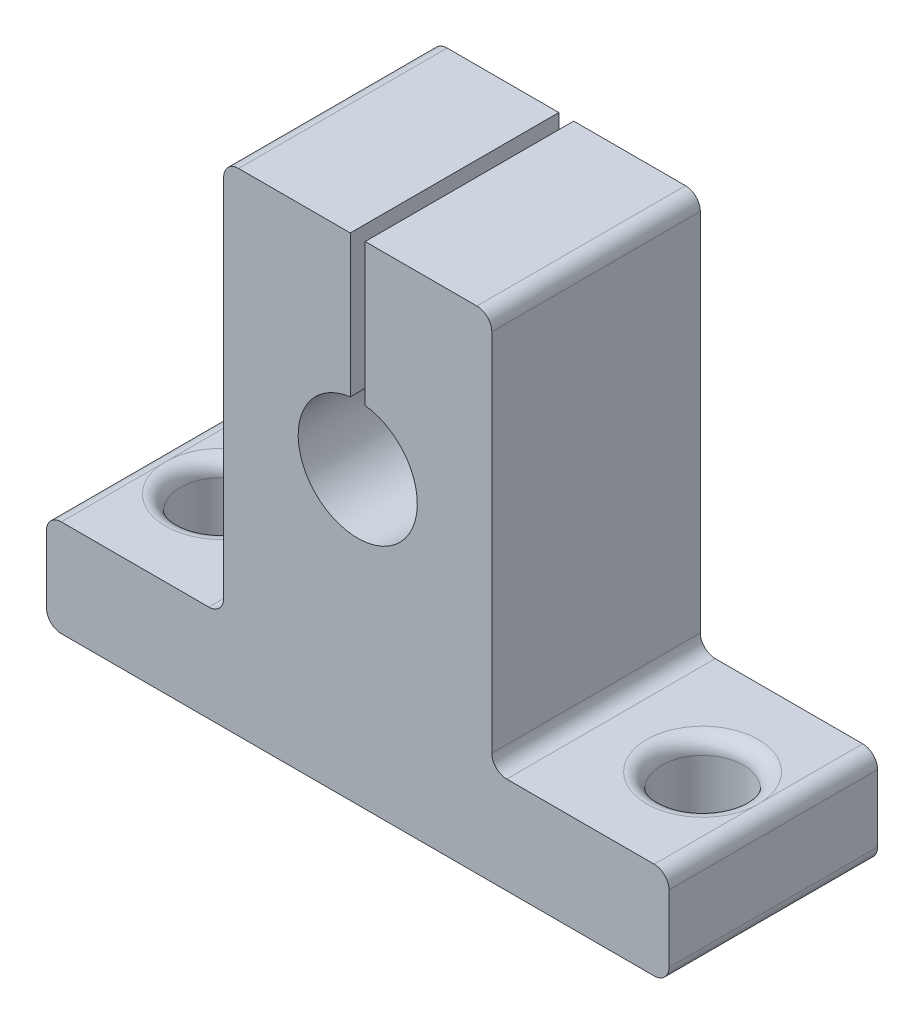
ISO-10303-21;
HEADER;
FILE_DESCRIPTION(('STEP AP214'),'2;1');
FILE_NAME('part.step','',(''),(''),'','','');
FILE_SCHEMA(('AUTOMOTIVE_DESIGN { 1 0 10303 214 1 1 1 1 }'));
ENDSEC;
DATA;
#1=APPLICATION_CONTEXT('core data for automotive mechanical design processes');
#2=APPLICATION_PROTOCOL_DEFINITION('international standard','automotive_design',2000,#1);
#3=PRODUCT_CONTEXT('',#1,'mechanical');
#4=PRODUCT('Part','Part','',(#3));
#5=PRODUCT_RELATED_PRODUCT_CATEGORY('part','',(#4));
#6=PRODUCT_DEFINITION_FORMATION('','',#4);
#7=PRODUCT_DEFINITION_CONTEXT('part definition',#1,'design');
#8=PRODUCT_DEFINITION('design','',#6,#7);
#9=PRODUCT_DEFINITION_SHAPE('','',#8);
#10=(LENGTH_UNIT() NAMED_UNIT(*) SI_UNIT(.MILLI.,.METRE.));
#11=(NAMED_UNIT(*) PLANE_ANGLE_UNIT() SI_UNIT($,.RADIAN.));
#12=(NAMED_UNIT(*) SI_UNIT($,.STERADIAN.) SOLID_ANGLE_UNIT());
#13=UNCERTAINTY_MEASURE_WITH_UNIT(LENGTH_MEASURE(1.E-05),#10,'distance_accuracy_value','');
#14=(GEOMETRIC_REPRESENTATION_CONTEXT(3) GLOBAL_UNCERTAINTY_ASSIGNED_CONTEXT((#13)) GLOBAL_UNIT_ASSIGNED_CONTEXT((#10,
#11,#12)) REPRESENTATION_CONTEXT('',''));
#15=CARTESIAN_POINT('',(0.,0.,0.));
#16=DIRECTION('',(0.,0.,1.));
#17=DIRECTION('',(1.,0.,0.));
#18=AXIS2_PLACEMENT_3D('',#15,#16,#17);
#19=CARTESIAN_POINT('',(-0.499999999999996,33.,14.));
#20=DIRECTION('',(-1.,0.,0.));
#21=DIRECTION('',(0.,-1.,0.));
#22=AXIS2_PLACEMENT_3D('',#19,#20,#21);
#23=PLANE('',#22);
#24=DIRECTION('',(0.,1.,0.));
#25=VECTOR('',#24,1.);
#26=CARTESIAN_POINT('',(-0.499999999999996,33.,0.));
#27=LINE('',#26,#25);
#28=CARTESIAN_POINT('',(-0.500000000000003,23.4686269665969,0.));
#29=VERTEX_POINT('',#28);
#30=CARTESIAN_POINT('',(-0.499999999999996,33.,0.));
#31=VERTEX_POINT('',#30);
#32=EDGE_CURVE('E210',#29,#31,#27,.T.);
#33=ORIENTED_EDGE('',*,*,#32,.T.);
#34=DIRECTION('',(0.,0.,-1.));
#35=VECTOR('',#34,1.);
#36=CARTESIAN_POINT('',(-0.499999999999996,33.,14.));
#37=LINE('',#36,#35);
#38=CARTESIAN_POINT('',(-0.499999999999996,33.,14.));
#39=VERTEX_POINT('',#38);
#40=EDGE_CURVE('E189',#39,#31,#37,.T.);
#41=ORIENTED_EDGE('',*,*,#40,.F.);
#42=DIRECTION('',(0.,1.,0.));
#43=VECTOR('',#42,1.);
#44=CARTESIAN_POINT('',(-0.499999999999996,33.,14.));
#45=LINE('',#44,#43);
#46=CARTESIAN_POINT('',(-0.500000000000003,23.4686269665969,14.));
#47=VERTEX_POINT('',#46);
#48=EDGE_CURVE('E197',#47,#39,#45,.T.);
#49=ORIENTED_EDGE('',*,*,#48,.F.);
#50=DIRECTION('',(0.,0.,-1.));
#51=VECTOR('',#50,1.);
#52=CARTESIAN_POINT('',(-0.500000000000003,23.4686269665969,14.));
#53=LINE('',#52,#51);
#54=EDGE_CURVE('E404',#47,#29,#53,.T.);
#55=ORIENTED_EDGE('',*,*,#54,.T.);
#56=EDGE_LOOP('',(#33,#41,#49,#55));
#57=FACE_BOUND('',#56,.T.);
#58=ADVANCED_FACE('F39',(#57),#23,.F.);
#59=CARTESIAN_POINT('',(-0.499999999999996,33.,14.));
#60=DIRECTION('',(0.,-1.,0.));
#61=DIRECTION('',(0.,0.,-1.));
#62=AXIS2_PLACEMENT_3D('',#59,#60,#61);
#63=PLANE('',#62);
#64=DIRECTION('',(-1.,0.,0.));
#65=VECTOR('',#64,1.);
#66=CARTESIAN_POINT('',(-0.499999999999996,33.,0.));
#67=LINE('',#66,#65);
#68=CARTESIAN_POINT('',(-7.99999999999999,33.,0.));
#69=VERTEX_POINT('',#68);
#70=EDGE_CURVE('E355',#31,#69,#67,.T.);
#71=ORIENTED_EDGE('',*,*,#70,.T.);
#72=DIRECTION('',(0.,0.,-1.));
#73=VECTOR('',#72,1.);
#74=CARTESIAN_POINT('',(-7.99999999999999,33.,14.));
#75=LINE('',#74,#73);
#76=CARTESIAN_POINT('',(-7.99999999999999,33.,14.));
#77=VERTEX_POINT('',#76);
#78=EDGE_CURVE('E192',#77,#69,#75,.T.);
#79=ORIENTED_EDGE('',*,*,#78,.F.);
#80=DIRECTION('',(-1.,0.,0.));
#81=VECTOR('',#80,1.);
#82=CARTESIAN_POINT('',(-0.499999999999996,33.,14.));
#83=LINE('',#82,#81);
#84=EDGE_CURVE('E185',#39,#77,#83,.T.);
#85=ORIENTED_EDGE('',*,*,#84,.F.);
#86=ORIENTED_EDGE('',*,*,#40,.T.);
#87=EDGE_LOOP('',(#71,#79,#85,#86));
#88=FACE_BOUND('',#87,.T.);
#89=ADVANCED_FACE('F187',(#88),#63,.F.);
#90=CARTESIAN_POINT('',(-8.,32.,14.));
#91=DIRECTION('',(0.,0.,-1.));
#92=DIRECTION('',(-1.,0.,0.));
#93=AXIS2_PLACEMENT_3D('',#90,#91,#92);
#94=CYLINDRICAL_SURFACE('',#93,1.);
#95=CARTESIAN_POINT('',(-8.,32.,0.));
#96=DIRECTION('',(0.,0.,1.));
#97=DIRECTION('',(1.,0.,0.));
#98=AXIS2_PLACEMENT_3D('',#95,#96,#97);
#99=CIRCLE('',#98,1.);
#100=CARTESIAN_POINT('',(-9.,32.,0.));
#101=VERTEX_POINT('',#100);
#102=EDGE_CURVE('E346',#69,#101,#99,.T.);
#103=ORIENTED_EDGE('',*,*,#102,.T.);
#104=DIRECTION('',(0.,0.,-1.));
#105=VECTOR('',#104,1.);
#106=CARTESIAN_POINT('',(-9.,32.,14.));
#107=LINE('',#106,#105);
#108=CARTESIAN_POINT('',(-9.,32.,14.));
#109=VERTEX_POINT('',#108);
#110=EDGE_CURVE('E219',#109,#101,#107,.T.);
#111=ORIENTED_EDGE('',*,*,#110,.F.);
#112=CARTESIAN_POINT('',(-8.,32.,14.));
#113=DIRECTION('',(0.,0.,1.));
#114=DIRECTION('',(1.,0.,0.));
#115=AXIS2_PLACEMENT_3D('',#112,#113,#114);
#116=CIRCLE('',#115,1.);
#117=EDGE_CURVE('E196',#77,#109,#116,.T.);
#118=ORIENTED_EDGE('',*,*,#117,.F.);
#119=ORIENTED_EDGE('',*,*,#78,.T.);
#120=EDGE_LOOP('',(#103,#111,#118,#119));
#121=FACE_BOUND('',#120,.T.);
#122=ADVANCED_FACE('F262',(#121),#94,.T.);
#123=CARTESIAN_POINT('',(-9.,32.,14.));
#124=DIRECTION('',(1.,0.,0.));
#125=DIRECTION('',(0.,1.,0.));
#126=AXIS2_PLACEMENT_3D('',#123,#124,#125);
#127=PLANE('',#126);
#128=DIRECTION('',(0.,-1.,0.));
#129=VECTOR('',#128,1.);
#130=CARTESIAN_POINT('',(-9.,32.,0.));
#131=LINE('',#130,#129);
#132=CARTESIAN_POINT('',(-9.,7.50000000000001,0.));
#133=VERTEX_POINT('',#132);
#134=EDGE_CURVE('E340',#101,#133,#131,.T.);
#135=ORIENTED_EDGE('',*,*,#134,.T.);
#136=DIRECTION('',(0.,0.,-1.));
#137=VECTOR('',#136,1.);
#138=CARTESIAN_POINT('',(-9.,7.50000000000001,14.));
#139=LINE('',#138,#137);
#140=CARTESIAN_POINT('',(-9.,7.50000000000001,14.));
#141=VERTEX_POINT('',#140);
#142=EDGE_CURVE('E329',#141,#133,#139,.T.);
#143=ORIENTED_EDGE('',*,*,#142,.F.);
#144=DIRECTION('',(0.,-1.,0.));
#145=VECTOR('',#144,1.);
#146=CARTESIAN_POINT('',(-9.,32.,14.));
#147=LINE('',#146,#145);
#148=EDGE_CURVE('E341',#109,#141,#147,.T.);
#149=ORIENTED_EDGE('',*,*,#148,.F.);
#150=ORIENTED_EDGE('',*,*,#110,.T.);
#151=EDGE_LOOP('',(#135,#143,#149,#150));
#152=FACE_BOUND('',#151,.T.);
#153=ADVANCED_FACE('F338',(#152),#127,.F.);
#154=CARTESIAN_POINT('',(-10.,7.5,14.));
#155=DIRECTION('',(0.,0.,-1.));
#156=DIRECTION('',(-1.,0.,0.));
#157=AXIS2_PLACEMENT_3D('',#154,#155,#156);
#158=CYLINDRICAL_SURFACE('',#157,1.);
#159=CARTESIAN_POINT('',(-10.,7.5,0.));
#160=DIRECTION('',(0.,0.,-1.));
#161=DIRECTION('',(-1.,0.,0.));
#162=AXIS2_PLACEMENT_3D('',#159,#160,#161);
#163=CIRCLE('',#162,1.);
#164=CARTESIAN_POINT('',(-10.,6.5,0.));
#165=VERTEX_POINT('',#164);
#166=EDGE_CURVE('E348',#133,#165,#163,.T.);
#167=ORIENTED_EDGE('',*,*,#166,.T.);
#168=DIRECTION('',(0.,0.,-1.));
#169=VECTOR('',#168,1.);
#170=CARTESIAN_POINT('',(-10.,6.5,14.));
#171=LINE('',#170,#169);
#172=CARTESIAN_POINT('',(-10.,6.5,14.));
#173=VERTEX_POINT('',#172);
#174=EDGE_CURVE('E325',#173,#165,#171,.T.);
#175=ORIENTED_EDGE('',*,*,#174,.F.);
#176=CARTESIAN_POINT('',(-10.,7.5,14.));
#177=DIRECTION('',(0.,0.,-1.));
#178=DIRECTION('',(-1.,0.,0.));
#179=AXIS2_PLACEMENT_3D('',#176,#177,#178);
#180=CIRCLE('',#179,1.);
#181=EDGE_CURVE('E490',#141,#173,#180,.T.);
#182=ORIENTED_EDGE('',*,*,#181,.F.);
#183=ORIENTED_EDGE('',*,*,#142,.T.);
#184=EDGE_LOOP('',(#167,#175,#182,#183));
#185=FACE_BOUND('',#184,.T.);
#186=ADVANCED_FACE('F537',(#185),#158,.F.);
#187=CARTESIAN_POINT('',(-10.,6.5,14.));
#188=DIRECTION('',(0.,-1.,0.));
#189=DIRECTION('',(1.,0.,0.));
#190=AXIS2_PLACEMENT_3D('',#187,#188,#189);
#191=PLANE('',#190);
#192=DIRECTION('',(0.,0.,-1.));
#193=VECTOR('',#192,1.);
#194=CARTESIAN_POINT('',(-19.9,6.49999999999999,14.));
#195=LINE('',#194,#193);
#196=CARTESIAN_POINT('',(-19.9,6.49999999999999,7.));
#197=VERTEX_POINT('',#196);
#198=CARTESIAN_POINT('',(-19.9,6.49999999999999,0.));
#199=VERTEX_POINT('',#198);
#200=EDGE_CURVE('E320',#197,#199,#195,.T.);
#201=ORIENTED_EDGE('',*,*,#200,.F.);
#202=CARTESIAN_POINT('',(-16.15,6.5,7.));
#203=DIRECTION('',(0.,-1.,0.));
#204=DIRECTION('',(1.,0.,0.));
#205=AXIS2_PLACEMENT_3D('',#202,#203,#204);
#206=CIRCLE('',#205,3.75);
#207=EDGE_CURVE('E11',#197,#197,#206,.T.);
#208=ORIENTED_EDGE('',*,*,#207,.T.);
#209=CARTESIAN_POINT('',(-19.9,6.49999999999999,14.));
#210=VERTEX_POINT('',#209);
#211=EDGE_CURVE('E321',#210,#197,#195,.T.);
#212=ORIENTED_EDGE('',*,*,#211,.F.);
#213=DIRECTION('',(-1.,0.,0.));
#214=VECTOR('',#213,1.);
#215=CARTESIAN_POINT('',(-10.,6.5,14.));
#216=LINE('',#215,#214);
#217=EDGE_CURVE('E495',#173,#210,#216,.T.);
#218=ORIENTED_EDGE('',*,*,#217,.F.);
#219=ORIENTED_EDGE('',*,*,#174,.T.);
#220=DIRECTION('',(-1.,0.,0.));
#221=VECTOR('',#220,1.);
#222=CARTESIAN_POINT('',(-10.,6.5,0.));
#223=LINE('',#222,#221);
#224=EDGE_CURVE('E353',#165,#199,#223,.T.);
#225=ORIENTED_EDGE('',*,*,#224,.T.);
#226=EDGE_LOOP('',(#201,#208,#212,#218,#219,#225));
#227=FACE_BOUND('',#226,.T.);
#228=ADVANCED_FACE('F532',(#227),#191,.F.);
#229=CARTESIAN_POINT('',(-19.9,5.49999999999999,14.));
#230=DIRECTION('',(0.,0.,-1.));
#231=DIRECTION('',(-1.,0.,0.));
#232=AXIS2_PLACEMENT_3D('',#229,#230,#231);
#233=CYLINDRICAL_SURFACE('',#232,1.);
#234=CARTESIAN_POINT('',(-19.9,5.49999999999999,0.));
#235=DIRECTION('',(0.,0.,1.));
#236=DIRECTION('',(1.,0.,0.));
#237=AXIS2_PLACEMENT_3D('',#234,#235,#236);
#238=CIRCLE('',#237,1.);
#239=CARTESIAN_POINT('',(-20.9,5.49999999999999,0.));
#240=VERTEX_POINT('',#239);
#241=EDGE_CURVE('E362',#199,#240,#238,.T.);
#242=ORIENTED_EDGE('',*,*,#241,.T.);
#243=DIRECTION('',(0.,0.,-1.));
#244=VECTOR('',#243,1.);
#245=CARTESIAN_POINT('',(-20.9,5.49999999999999,14.));
#246=LINE('',#245,#244);
#247=CARTESIAN_POINT('',(-20.9,5.49999999999999,14.));
#248=VERTEX_POINT('',#247);
#249=EDGE_CURVE('E316',#248,#240,#246,.T.);
#250=ORIENTED_EDGE('',*,*,#249,.F.);
#251=CARTESIAN_POINT('',(-19.9,5.49999999999999,14.));
#252=DIRECTION('',(0.,0.,1.));
#253=DIRECTION('',(1.,0.,0.));
#254=AXIS2_PLACEMENT_3D('',#251,#252,#253);
#255=CIRCLE('',#254,1.);
#256=EDGE_CURVE('E498',#210,#248,#255,.T.);
#257=ORIENTED_EDGE('',*,*,#256,.F.);
#258=ORIENTED_EDGE('',*,*,#211,.T.);
#259=ORIENTED_EDGE('',*,*,#200,.T.);
#260=EDGE_LOOP('',(#242,#250,#257,#258,#259));
#261=FACE_BOUND('',#260,.T.);
#262=ADVANCED_FACE('F527',(#261),#233,.T.);
#263=CARTESIAN_POINT('',(-20.9,5.49999999999999,14.));
#264=DIRECTION('',(1.,0.,0.));
#265=DIRECTION('',(0.,0.,-1.));
#266=AXIS2_PLACEMENT_3D('',#263,#264,#265);
#267=PLANE('',#266);
#268=DIRECTION('',(0.,-1.,0.));
#269=VECTOR('',#268,1.);
#270=CARTESIAN_POINT('',(-20.9,5.49999999999999,0.));
#271=LINE('',#270,#269);
#272=CARTESIAN_POINT('',(-20.9,1.00000000000001,0.));
#273=VERTEX_POINT('',#272);
#274=EDGE_CURVE('E365',#240,#273,#271,.T.);
#275=ORIENTED_EDGE('',*,*,#274,.T.);
#276=DIRECTION('',(0.,0.,-1.));
#277=VECTOR('',#276,1.);
#278=CARTESIAN_POINT('',(-20.9,1.00000000000001,14.));
#279=LINE('',#278,#277);
#280=CARTESIAN_POINT('',(-20.9,1.00000000000001,14.));
#281=VERTEX_POINT('',#280);
#282=EDGE_CURVE('E312',#281,#273,#279,.T.);
#283=ORIENTED_EDGE('',*,*,#282,.F.);
#284=DIRECTION('',(0.,-1.,0.));
#285=VECTOR('',#284,1.);
#286=CARTESIAN_POINT('',(-20.9,5.49999999999999,14.));
#287=LINE('',#286,#285);
#288=EDGE_CURVE('E501',#248,#281,#287,.T.);
#289=ORIENTED_EDGE('',*,*,#288,.F.);
#290=ORIENTED_EDGE('',*,*,#249,.T.);
#291=EDGE_LOOP('',(#275,#283,#289,#290));
#292=FACE_BOUND('',#291,.T.);
#293=ADVANCED_FACE('F522',(#292),#267,.F.);
#294=CARTESIAN_POINT('',(-19.9,1.,14.));
#295=DIRECTION('',(0.,0.,-1.));
#296=DIRECTION('',(-1.,0.,0.));
#297=AXIS2_PLACEMENT_3D('',#294,#295,#296);
#298=CYLINDRICAL_SURFACE('',#297,1.);
#299=CARTESIAN_POINT('',(-19.9,1.,0.));
#300=DIRECTION('',(0.,0.,1.));
#301=DIRECTION('',(1.,0.,0.));
#302=AXIS2_PLACEMENT_3D('',#299,#300,#301);
#303=CIRCLE('',#302,1.);
#304=CARTESIAN_POINT('',(-19.9,0.,0.));
#305=VERTEX_POINT('',#304);
#306=EDGE_CURVE('E368',#273,#305,#303,.T.);
#307=ORIENTED_EDGE('',*,*,#306,.T.);
#308=DIRECTION('',(0.,0.,-1.));
#309=VECTOR('',#308,1.);
#310=CARTESIAN_POINT('',(-19.9,0.,14.));
#311=LINE('',#310,#309);
#312=CARTESIAN_POINT('',(-19.9,0.,7.));
#313=VERTEX_POINT('',#312);
#314=EDGE_CURVE('E303',#313,#305,#311,.T.);
#315=ORIENTED_EDGE('',*,*,#314,.F.);
#316=CARTESIAN_POINT('',(-19.9,0.,14.));
#317=VERTEX_POINT('',#316);
#318=EDGE_CURVE('E305',#317,#313,#311,.T.);
#319=ORIENTED_EDGE('',*,*,#318,.F.);
#320=CARTESIAN_POINT('',(-19.9,1.,14.));
#321=DIRECTION('',(0.,0.,1.));
#322=DIRECTION('',(1.,0.,0.));
#323=AXIS2_PLACEMENT_3D('',#320,#321,#322);
#324=CIRCLE('',#323,1.);
#325=EDGE_CURVE('E504',#281,#317,#324,.T.);
#326=ORIENTED_EDGE('',*,*,#325,.F.);
#327=ORIENTED_EDGE('',*,*,#282,.T.);
#328=EDGE_LOOP('',(#307,#315,#319,#326,#327));
#329=FACE_BOUND('',#328,.T.);
#330=ADVANCED_FACE('F516',(#329),#298,.T.);
#331=CARTESIAN_POINT('',(-19.9,0.,14.));
#332=DIRECTION('',(0.,1.,0.));
#333=DIRECTION('',(0.,0.,1.));
#334=AXIS2_PLACEMENT_3D('',#331,#332,#333);
#335=PLANE('',#334);
#336=DIRECTION('',(0.,0.,-1.));
#337=VECTOR('',#336,1.);
#338=CARTESIAN_POINT('',(19.9,0.,14.));
#339=LINE('',#338,#337);
#340=CARTESIAN_POINT('',(19.9,0.,7.));
#341=VERTEX_POINT('',#340);
#342=CARTESIAN_POINT('',(19.9,0.,0.));
#343=VERTEX_POINT('',#342);
#344=EDGE_CURVE('E291',#341,#343,#339,.T.);
#345=ORIENTED_EDGE('',*,*,#344,.F.);
#346=CARTESIAN_POINT('',(16.15,0.,7.));
#347=DIRECTION('',(0.,1.,0.));
#348=DIRECTION('',(0.,0.,1.));
#349=AXIS2_PLACEMENT_3D('',#346,#347,#348);
#350=CIRCLE('',#349,3.75);
#351=EDGE_CURVE('E232',#341,#341,#350,.T.);
#352=ORIENTED_EDGE('',*,*,#351,.T.);
#353=CARTESIAN_POINT('',(19.9,0.,14.));
#354=VERTEX_POINT('',#353);
#355=EDGE_CURVE('E288',#354,#341,#339,.T.);
#356=ORIENTED_EDGE('',*,*,#355,.F.);
#357=DIRECTION('',(1.,0.,0.));
#358=VECTOR('',#357,1.);
#359=CARTESIAN_POINT('',(-19.9,0.,14.));
#360=LINE('',#359,#358);
#361=EDGE_CURVE('E507',#317,#354,#360,.T.);
#362=ORIENTED_EDGE('',*,*,#361,.F.);
#363=ORIENTED_EDGE('',*,*,#318,.T.);
#364=CARTESIAN_POINT('',(-16.15,0.,7.));
#365=DIRECTION('',(0.,1.,0.));
#366=DIRECTION('',(0.,0.,1.));
#367=AXIS2_PLACEMENT_3D('',#364,#365,#366);
#368=CIRCLE('',#367,3.75);
#369=EDGE_CURVE('E56',#313,#313,#368,.T.);
#370=ORIENTED_EDGE('',*,*,#369,.T.);
#371=ORIENTED_EDGE('',*,*,#314,.T.);
#372=DIRECTION('',(1.,0.,0.));
#373=VECTOR('',#372,1.);
#374=CARTESIAN_POINT('',(-19.9,0.,0.));
#375=LINE('',#374,#373);
#376=EDGE_CURVE('E293',#305,#343,#375,.T.);
#377=ORIENTED_EDGE('',*,*,#376,.T.);
#378=EDGE_LOOP('',(#345,#352,#356,#362,#363,#370,#371,#377));
#379=FACE_BOUND('',#378,.T.);
#380=ADVANCED_FACE('F285',(#379),#335,.F.);
#381=CARTESIAN_POINT('',(19.9,1.,14.));
#382=DIRECTION('',(0.,0.,-1.));
#383=DIRECTION('',(-1.,0.,0.));
#384=AXIS2_PLACEMENT_3D('',#381,#382,#383);
#385=CYLINDRICAL_SURFACE('',#384,1.);
#386=CARTESIAN_POINT('',(19.9,1.,0.));
#387=DIRECTION('',(0.,0.,1.));
#388=DIRECTION('',(-1.,0.,0.));
#389=AXIS2_PLACEMENT_3D('',#386,#387,#388);
#390=CIRCLE('',#389,1.);
#391=CARTESIAN_POINT('',(20.9,1.00000000000001,0.));
#392=VERTEX_POINT('',#391);
#393=EDGE_CURVE('E374',#343,#392,#390,.T.);
#394=ORIENTED_EDGE('',*,*,#393,.T.);
#395=DIRECTION('',(0.,0.,-1.));
#396=VECTOR('',#395,1.);
#397=CARTESIAN_POINT('',(20.9,1.00000000000001,14.));
#398=LINE('',#397,#396);
#399=CARTESIAN_POINT('',(20.9,1.00000000000001,14.));
#400=VERTEX_POINT('',#399);
#401=EDGE_CURVE('E297',#400,#392,#398,.T.);
#402=ORIENTED_EDGE('',*,*,#401,.F.);
#403=CARTESIAN_POINT('',(19.9,1.,14.));
#404=DIRECTION('',(0.,0.,1.));
#405=DIRECTION('',(-1.,0.,0.));
#406=AXIS2_PLACEMENT_3D('',#403,#404,#405);
#407=CIRCLE('',#406,1.);
#408=EDGE_CURVE('E301',#354,#400,#407,.T.);
#409=ORIENTED_EDGE('',*,*,#408,.F.);
#410=ORIENTED_EDGE('',*,*,#355,.T.);
#411=ORIENTED_EDGE('',*,*,#344,.T.);
#412=EDGE_LOOP('',(#394,#402,#409,#410,#411));
#413=FACE_BOUND('',#412,.T.);
#414=ADVANCED_FACE('F299',(#413),#385,.T.);
#415=CARTESIAN_POINT('',(20.9,5.49999999999999,14.));
#416=DIRECTION('',(-1.,0.,0.));
#417=DIRECTION('',(0.,0.,1.));
#418=AXIS2_PLACEMENT_3D('',#415,#416,#417);
#419=PLANE('',#418);
#420=DIRECTION('',(0.,1.,0.));
#421=VECTOR('',#420,1.);
#422=CARTESIAN_POINT('',(20.9,5.49999999999999,0.));
#423=LINE('',#422,#421);
#424=CARTESIAN_POINT('',(20.9,5.49999999999999,0.));
#425=VERTEX_POINT('',#424);
#426=EDGE_CURVE('E377',#392,#425,#423,.T.);
#427=ORIENTED_EDGE('',*,*,#426,.T.);
#428=DIRECTION('',(0.,0.,-1.));
#429=VECTOR('',#428,1.);
#430=CARTESIAN_POINT('',(20.9,5.49999999999999,14.));
#431=LINE('',#430,#429);
#432=CARTESIAN_POINT('',(20.9,5.49999999999999,14.));
#433=VERTEX_POINT('',#432);
#434=EDGE_CURVE('E435',#433,#425,#431,.T.);
#435=ORIENTED_EDGE('',*,*,#434,.F.);
#436=DIRECTION('',(0.,1.,0.));
#437=VECTOR('',#436,1.);
#438=CARTESIAN_POINT('',(20.9,5.49999999999999,14.));
#439=LINE('',#438,#437);
#440=EDGE_CURVE('E448',#400,#433,#439,.T.);
#441=ORIENTED_EDGE('',*,*,#440,.F.);
#442=ORIENTED_EDGE('',*,*,#401,.T.);
#443=EDGE_LOOP('',(#427,#435,#441,#442));
#444=FACE_BOUND('',#443,.T.);
#445=ADVANCED_FACE('F447',(#444),#419,.F.);
#446=CARTESIAN_POINT('',(19.9,5.49999999999999,14.));
#447=DIRECTION('',(0.,0.,-1.));
#448=DIRECTION('',(-1.,0.,0.));
#449=AXIS2_PLACEMENT_3D('',#446,#447,#448);
#450=CYLINDRICAL_SURFACE('',#449,1.);
#451=CARTESIAN_POINT('',(19.9,5.49999999999999,0.));
#452=DIRECTION('',(0.,0.,1.));
#453=DIRECTION('',(1.,0.,0.));
#454=AXIS2_PLACEMENT_3D('',#451,#452,#453);
#455=CIRCLE('',#454,1.);
#456=CARTESIAN_POINT('',(19.9,6.49999999999999,0.));
#457=VERTEX_POINT('',#456);
#458=EDGE_CURVE('E380',#425,#457,#455,.T.);
#459=ORIENTED_EDGE('',*,*,#458,.T.);
#460=DIRECTION('',(0.,0.,-1.));
#461=VECTOR('',#460,1.);
#462=CARTESIAN_POINT('',(19.9,6.49999999999999,14.));
#463=LINE('',#462,#461);
#464=CARTESIAN_POINT('',(19.9,6.49999999999999,7.));
#465=VERTEX_POINT('',#464);
#466=EDGE_CURVE('E431',#465,#457,#463,.T.);
#467=ORIENTED_EDGE('',*,*,#466,.F.);
#468=CARTESIAN_POINT('',(19.9,6.49999999999999,14.));
#469=VERTEX_POINT('',#468);
#470=EDGE_CURVE('E432',#469,#465,#463,.T.);
#471=ORIENTED_EDGE('',*,*,#470,.F.);
#472=CARTESIAN_POINT('',(19.9,5.49999999999999,14.));
#473=DIRECTION('',(0.,0.,1.));
#474=DIRECTION('',(1.,0.,0.));
#475=AXIS2_PLACEMENT_3D('',#472,#473,#474);
#476=CIRCLE('',#475,1.);
#477=EDGE_CURVE('E463',#433,#469,#476,.T.);
#478=ORIENTED_EDGE('',*,*,#477,.F.);
#479=ORIENTED_EDGE('',*,*,#434,.T.);
#480=EDGE_LOOP('',(#459,#467,#471,#478,#479));
#481=FACE_BOUND('',#480,.T.);
#482=ADVANCED_FACE('F452',(#481),#450,.T.);
#483=CARTESIAN_POINT('',(10.,6.5,14.));
#484=DIRECTION('',(0.,-1.,0.));
#485=DIRECTION('',(1.,0.,0.));
#486=AXIS2_PLACEMENT_3D('',#483,#484,#485);
#487=PLANE('',#486);
#488=ORIENTED_EDGE('',*,*,#470,.T.);
#489=CARTESIAN_POINT('',(16.15,6.5,7.));
#490=DIRECTION('',(0.,-1.,0.));
#491=DIRECTION('',(1.,0.,0.));
#492=AXIS2_PLACEMENT_3D('',#489,#490,#491);
#493=CIRCLE('',#492,3.75);
#494=EDGE_CURVE('E226',#465,#465,#493,.T.);
#495=ORIENTED_EDGE('',*,*,#494,.T.);
#496=ORIENTED_EDGE('',*,*,#466,.T.);
#497=DIRECTION('',(-1.,0.,0.));
#498=VECTOR('',#497,1.);
#499=CARTESIAN_POINT('',(10.,6.5,0.));
#500=LINE('',#499,#498);
#501=CARTESIAN_POINT('',(10.,6.5,0.));
#502=VERTEX_POINT('',#501);
#503=EDGE_CURVE('E384',#457,#502,#500,.T.);
#504=ORIENTED_EDGE('',*,*,#503,.T.);
#505=DIRECTION('',(0.,0.,-1.));
#506=VECTOR('',#505,1.);
#507=CARTESIAN_POINT('',(10.,6.5,14.));
#508=LINE('',#507,#506);
#509=CARTESIAN_POINT('',(10.,6.5,14.));
#510=VERTEX_POINT('',#509);
#511=EDGE_CURVE('E427',#510,#502,#508,.T.);
#512=ORIENTED_EDGE('',*,*,#511,.F.);
#513=DIRECTION('',(-1.,0.,0.));
#514=VECTOR('',#513,1.);
#515=CARTESIAN_POINT('',(10.,6.5,14.));
#516=LINE('',#515,#514);
#517=EDGE_CURVE('E459',#469,#510,#516,.T.);
#518=ORIENTED_EDGE('',*,*,#517,.F.);
#519=EDGE_LOOP('',(#488,#495,#496,#504,#512,#518));
#520=FACE_BOUND('',#519,.T.);
#521=ADVANCED_FACE('F457',(#520),#487,.F.);
#522=CARTESIAN_POINT('',(10.,7.5,14.));
#523=DIRECTION('',(0.,0.,-1.));
#524=DIRECTION('',(-1.,0.,0.));
#525=AXIS2_PLACEMENT_3D('',#522,#523,#524);
#526=CYLINDRICAL_SURFACE('',#525,1.);
#527=CARTESIAN_POINT('',(10.,7.5,0.));
#528=DIRECTION('',(0.,0.,-1.));
#529=DIRECTION('',(-1.,0.,0.));
#530=AXIS2_PLACEMENT_3D('',#527,#528,#529);
#531=CIRCLE('',#530,1.);
#532=CARTESIAN_POINT('',(9.,7.5,0.));
#533=VERTEX_POINT('',#532);
#534=EDGE_CURVE('E387',#502,#533,#531,.T.);
#535=ORIENTED_EDGE('',*,*,#534,.T.);
#536=DIRECTION('',(0.,0.,-1.));
#537=VECTOR('',#536,1.);
#538=CARTESIAN_POINT('',(9.,7.5,14.));
#539=LINE('',#538,#537);
#540=CARTESIAN_POINT('',(9.,7.5,14.));
#541=VERTEX_POINT('',#540);
#542=EDGE_CURVE('E423',#541,#533,#539,.T.);
#543=ORIENTED_EDGE('',*,*,#542,.F.);
#544=CARTESIAN_POINT('',(10.,7.5,14.));
#545=DIRECTION('',(0.,0.,-1.));
#546=DIRECTION('',(-1.,0.,0.));
#547=AXIS2_PLACEMENT_3D('',#544,#545,#546);
#548=CIRCLE('',#547,1.);
#549=EDGE_CURVE('E462',#510,#541,#548,.T.);
#550=ORIENTED_EDGE('',*,*,#549,.F.);
#551=ORIENTED_EDGE('',*,*,#511,.T.);
#552=EDGE_LOOP('',(#535,#543,#550,#551));
#553=FACE_BOUND('',#552,.T.);
#554=ADVANCED_FACE('F590',(#553),#526,.F.);
#555=CARTESIAN_POINT('',(9.,32.,14.));
#556=DIRECTION('',(-1.,0.,0.));
#557=DIRECTION('',(0.,-1.,0.));
#558=AXIS2_PLACEMENT_3D('',#555,#556,#557);
#559=PLANE('',#558);
#560=DIRECTION('',(0.,1.,0.));
#561=VECTOR('',#560,1.);
#562=CARTESIAN_POINT('',(9.,32.,0.));
#563=LINE('',#562,#561);
#564=CARTESIAN_POINT('',(9.,32.,0.));
#565=VERTEX_POINT('',#564);
#566=EDGE_CURVE('E390',#533,#565,#563,.T.);
#567=ORIENTED_EDGE('',*,*,#566,.T.);
#568=DIRECTION('',(0.,0.,-1.));
#569=VECTOR('',#568,1.);
#570=CARTESIAN_POINT('',(9.,32.,14.));
#571=LINE('',#570,#569);
#572=CARTESIAN_POINT('',(9.,32.,14.));
#573=VERTEX_POINT('',#572);
#574=EDGE_CURVE('E419',#573,#565,#571,.T.);
#575=ORIENTED_EDGE('',*,*,#574,.F.);
#576=DIRECTION('',(0.,1.,0.));
#577=VECTOR('',#576,1.);
#578=CARTESIAN_POINT('',(9.,32.,14.));
#579=LINE('',#578,#577);
#580=EDGE_CURVE('E467',#541,#573,#579,.T.);
#581=ORIENTED_EDGE('',*,*,#580,.F.);
#582=ORIENTED_EDGE('',*,*,#542,.T.);
#583=EDGE_LOOP('',(#567,#575,#581,#582));
#584=FACE_BOUND('',#583,.T.);
#585=ADVANCED_FACE('F595',(#584),#559,.F.);
#586=CARTESIAN_POINT('',(8.,32.,14.));
#587=DIRECTION('',(0.,0.,-1.));
#588=DIRECTION('',(-1.,0.,0.));
#589=AXIS2_PLACEMENT_3D('',#586,#587,#588);
#590=CYLINDRICAL_SURFACE('',#589,1.);
#591=CARTESIAN_POINT('',(8.,32.,0.));
#592=DIRECTION('',(0.,0.,1.));
#593=DIRECTION('',(1.,0.,0.));
#594=AXIS2_PLACEMENT_3D('',#591,#592,#593);
#595=CIRCLE('',#594,1.);
#596=CARTESIAN_POINT('',(7.99999999999999,33.,0.));
#597=VERTEX_POINT('',#596);
#598=EDGE_CURVE('E393',#565,#597,#595,.T.);
#599=ORIENTED_EDGE('',*,*,#598,.T.);
#600=DIRECTION('',(0.,0.,-1.));
#601=VECTOR('',#600,1.);
#602=CARTESIAN_POINT('',(7.99999999999999,33.,14.));
#603=LINE('',#602,#601);
#604=CARTESIAN_POINT('',(7.99999999999999,33.,14.));
#605=VERTEX_POINT('',#604);
#606=EDGE_CURVE('E415',#605,#597,#603,.T.);
#607=ORIENTED_EDGE('',*,*,#606,.F.);
#608=CARTESIAN_POINT('',(8.,32.,14.));
#609=DIRECTION('',(0.,0.,1.));
#610=DIRECTION('',(1.,0.,0.));
#611=AXIS2_PLACEMENT_3D('',#608,#609,#610);
#612=CIRCLE('',#611,1.);
#613=EDGE_CURVE('E474',#573,#605,#612,.T.);
#614=ORIENTED_EDGE('',*,*,#613,.F.);
#615=ORIENTED_EDGE('',*,*,#574,.T.);
#616=EDGE_LOOP('',(#599,#607,#614,#615));
#617=FACE_BOUND('',#616,.T.);
#618=ADVANCED_FACE('F607',(#617),#590,.T.);
#619=CARTESIAN_POINT('',(0.499999999999996,33.,14.));
#620=DIRECTION('',(0.,-1.,0.));
#621=DIRECTION('',(0.,0.,-1.));
#622=AXIS2_PLACEMENT_3D('',#619,#620,#621);
#623=PLANE('',#622);
#624=DIRECTION('',(-1.,0.,0.));
#625=VECTOR('',#624,1.);
#626=CARTESIAN_POINT('',(0.499999999999996,33.,0.));
#627=LINE('',#626,#625);
#628=CARTESIAN_POINT('',(0.499999999999996,33.,0.));
#629=VERTEX_POINT('',#628);
#630=EDGE_CURVE('E396',#597,#629,#627,.T.);
#631=ORIENTED_EDGE('',*,*,#630,.T.);
#632=DIRECTION('',(0.,0.,-1.));
#633=VECTOR('',#632,1.);
#634=CARTESIAN_POINT('',(0.499999999999996,33.,14.));
#635=LINE('',#634,#633);
#636=CARTESIAN_POINT('',(0.499999999999996,33.,14.));
#637=VERTEX_POINT('',#636);
#638=EDGE_CURVE('E411',#637,#629,#635,.T.);
#639=ORIENTED_EDGE('',*,*,#638,.F.);
#640=DIRECTION('',(-1.,0.,0.));
#641=VECTOR('',#640,1.);
#642=CARTESIAN_POINT('',(0.499999999999996,33.,14.));
#643=LINE('',#642,#641);
#644=EDGE_CURVE('E477',#605,#637,#643,.T.);
#645=ORIENTED_EDGE('',*,*,#644,.F.);
#646=ORIENTED_EDGE('',*,*,#606,.T.);
#647=EDGE_LOOP('',(#631,#639,#645,#646));
#648=FACE_BOUND('',#647,.T.);
#649=ADVANCED_FACE('F617',(#648),#623,.F.);
#650=CARTESIAN_POINT('',(0.499999999999996,33.,14.));
#651=DIRECTION('',(1.,0.,0.));
#652=DIRECTION('',(0.,1.,0.));
#653=AXIS2_PLACEMENT_3D('',#650,#651,#652);
#654=PLANE('',#653);
#655=DIRECTION('',(0.,-1.,0.));
#656=VECTOR('',#655,1.);
#657=CARTESIAN_POINT('',(0.499999999999996,33.,0.));
#658=LINE('',#657,#656);
#659=CARTESIAN_POINT('',(0.500000000000003,23.4686269665969,0.));
#660=VERTEX_POINT('',#659);
#661=EDGE_CURVE('E399',#629,#660,#658,.T.);
#662=ORIENTED_EDGE('',*,*,#661,.T.);
#663=DIRECTION('',(0.,0.,-1.));
#664=VECTOR('',#663,1.);
#665=CARTESIAN_POINT('',(0.500000000000003,23.4686269665969,14.));
#666=LINE('',#665,#664);
#667=CARTESIAN_POINT('',(0.500000000000003,23.4686269665969,14.));
#668=VERTEX_POINT('',#667);
#669=EDGE_CURVE('E407',#668,#660,#666,.T.);
#670=ORIENTED_EDGE('',*,*,#669,.F.);
#671=DIRECTION('',(0.,-1.,0.));
#672=VECTOR('',#671,1.);
#673=CARTESIAN_POINT('',(0.499999999999996,33.,14.));
#674=LINE('',#673,#672);
#675=EDGE_CURVE('E480',#637,#668,#674,.T.);
#676=ORIENTED_EDGE('',*,*,#675,.F.);
#677=ORIENTED_EDGE('',*,*,#638,.T.);
#678=EDGE_LOOP('',(#662,#670,#676,#677));
#679=FACE_BOUND('',#678,.T.);
#680=ADVANCED_FACE('F627',(#679),#654,.F.);
#681=CARTESIAN_POINT('',(0.,19.5,14.));
#682=DIRECTION('',(0.,0.,-1.));
#683=DIRECTION('',(-1.,0.,0.));
#684=AXIS2_PLACEMENT_3D('',#681,#682,#683);
#685=CYLINDRICAL_SURFACE('',#684,4.);
#686=CARTESIAN_POINT('',(0.,19.5,0.));
#687=DIRECTION('',(0.,0.,-1.));
#688=DIRECTION('',(1.,0.,0.));
#689=AXIS2_PLACEMENT_3D('',#686,#687,#688);
#690=CIRCLE('',#689,4.);
#691=EDGE_CURVE('E207',#660,#29,#690,.T.);
#692=ORIENTED_EDGE('',*,*,#691,.T.);
#693=ORIENTED_EDGE('',*,*,#54,.F.);
#694=CARTESIAN_POINT('',(0.,19.5,14.));
#695=DIRECTION('',(0.,0.,-1.));
#696=DIRECTION('',(1.,0.,0.));
#697=AXIS2_PLACEMENT_3D('',#694,#695,#696);
#698=CIRCLE('',#697,4.);
#699=EDGE_CURVE('E202',#668,#47,#698,.T.);
#700=ORIENTED_EDGE('',*,*,#699,.F.);
#701=ORIENTED_EDGE('',*,*,#669,.T.);
#702=EDGE_LOOP('',(#692,#693,#700,#701));
#703=FACE_BOUND('',#702,.T.);
#704=ADVANCED_FACE('F637',(#703),#685,.F.);
#705=CARTESIAN_POINT('',(0.,19.5,14.));
#706=DIRECTION('',(0.,0.,1.));
#707=DIRECTION('',(1.,0.,0.));
#708=AXIS2_PLACEMENT_3D('',#705,#706,#707);
#709=PLANE('',#708);
#710=ORIENTED_EDGE('',*,*,#48,.T.);
#711=ORIENTED_EDGE('',*,*,#84,.T.);
#712=ORIENTED_EDGE('',*,*,#117,.T.);
#713=ORIENTED_EDGE('',*,*,#148,.T.);
#714=ORIENTED_EDGE('',*,*,#181,.T.);
#715=ORIENTED_EDGE('',*,*,#217,.T.);
#716=ORIENTED_EDGE('',*,*,#256,.T.);
#717=ORIENTED_EDGE('',*,*,#288,.T.);
#718=ORIENTED_EDGE('',*,*,#325,.T.);
#719=ORIENTED_EDGE('',*,*,#361,.T.);
#720=ORIENTED_EDGE('',*,*,#408,.T.);
#721=ORIENTED_EDGE('',*,*,#440,.T.);
#722=ORIENTED_EDGE('',*,*,#477,.T.);
#723=ORIENTED_EDGE('',*,*,#517,.T.);
#724=ORIENTED_EDGE('',*,*,#549,.T.);
#725=ORIENTED_EDGE('',*,*,#580,.T.);
#726=ORIENTED_EDGE('',*,*,#613,.T.);
#727=ORIENTED_EDGE('',*,*,#644,.T.);
#728=ORIENTED_EDGE('',*,*,#675,.T.);
#729=ORIENTED_EDGE('',*,*,#699,.T.);
#730=EDGE_LOOP('',(#710,#711,#712,#713,#714,#715,#716,#717,#718,#719,#720,#721,#722,#723,#724,
#725,#726,#727,#728,#729));
#731=FACE_BOUND('',#730,.T.);
#732=ADVANCED_FACE('F200',(#731),#709,.T.);
#733=CARTESIAN_POINT('',(0.,19.5,0.));
#734=DIRECTION('',(0.,0.,1.));
#735=DIRECTION('',(1.,0.,0.));
#736=AXIS2_PLACEMENT_3D('',#733,#734,#735);
#737=PLANE('',#736);
#738=ORIENTED_EDGE('',*,*,#32,.F.);
#739=ORIENTED_EDGE('',*,*,#691,.F.);
#740=ORIENTED_EDGE('',*,*,#661,.F.);
#741=ORIENTED_EDGE('',*,*,#630,.F.);
#742=ORIENTED_EDGE('',*,*,#598,.F.);
#743=ORIENTED_EDGE('',*,*,#566,.F.);
#744=ORIENTED_EDGE('',*,*,#534,.F.);
#745=ORIENTED_EDGE('',*,*,#503,.F.);
#746=ORIENTED_EDGE('',*,*,#458,.F.);
#747=ORIENTED_EDGE('',*,*,#426,.F.);
#748=ORIENTED_EDGE('',*,*,#393,.F.);
#749=ORIENTED_EDGE('',*,*,#376,.F.);
#750=ORIENTED_EDGE('',*,*,#306,.F.);
#751=ORIENTED_EDGE('',*,*,#274,.F.);
#752=ORIENTED_EDGE('',*,*,#241,.F.);
#753=ORIENTED_EDGE('',*,*,#224,.F.);
#754=ORIENTED_EDGE('',*,*,#166,.F.);
#755=ORIENTED_EDGE('',*,*,#134,.F.);
#756=ORIENTED_EDGE('',*,*,#102,.F.);
#757=ORIENTED_EDGE('',*,*,#70,.F.);
#758=EDGE_LOOP('',(#738,#739,#740,#741,#742,#743,#744,#745,#746,#747,#748,#749,#750,#751,#752,
#753,#754,#755,#756,#757));
#759=FACE_BOUND('',#758,.T.);
#760=ADVANCED_FACE('F278',(#759),#737,.F.);
#761=CARTESIAN_POINT('',(16.15,14.,7.));
#762=DIRECTION('',(0.,-1.,0.));
#763=DIRECTION('',(0.,0.,-1.));
#764=AXIS2_PLACEMENT_3D('',#761,#762,#763);
#765=CYLINDRICAL_SURFACE('',#764,2.75);
#766=CARTESIAN_POINT('',(16.15,5.5,7.));
#767=DIRECTION('',(0.,-1.,0.));
#768=DIRECTION('',(1.,0.,0.));
#769=AXIS2_PLACEMENT_3D('',#766,#767,#768);
#770=CIRCLE('',#769,2.75);
#771=CARTESIAN_POINT('',(18.9,5.49999999999999,7.));
#772=VERTEX_POINT('',#771);
#773=EDGE_CURVE('E217',#772,#772,#770,.F.);
#774=ORIENTED_EDGE('',*,*,#773,.T.);
#775=EDGE_LOOP('',(#774));
#776=FACE_BOUND('',#775,.T.);
#777=CARTESIAN_POINT('',(16.15,0.999999999999999,7.));
#778=DIRECTION('',(0.,1.,0.));
#779=DIRECTION('',(0.,0.,1.));
#780=AXIS2_PLACEMENT_3D('',#777,#778,#779);
#781=CIRCLE('',#780,2.75);
#782=CARTESIAN_POINT('',(16.15,0.999999999999999,9.75));
#783=VERTEX_POINT('',#782);
#784=EDGE_CURVE('E212',#783,#783,#781,.F.);
#785=ORIENTED_EDGE('',*,*,#784,.T.);
#786=EDGE_LOOP('',(#785));
#787=FACE_BOUND('',#786,.T.);
#788=ADVANCED_FACE('F271',(#776,#787),#765,.F.);
#789=CARTESIAN_POINT('',(-16.15,14.,7.));
#790=DIRECTION('',(0.,-1.,0.));
#791=DIRECTION('',(0.,0.,-1.));
#792=AXIS2_PLACEMENT_3D('',#789,#790,#791);
#793=CYLINDRICAL_SURFACE('',#792,2.75);
#794=CARTESIAN_POINT('',(-16.15,5.5,7.));
#795=DIRECTION('',(0.,-1.,0.));
#796=DIRECTION('',(1.,0.,0.));
#797=AXIS2_PLACEMENT_3D('',#794,#795,#796);
#798=CIRCLE('',#797,2.75);
#799=CARTESIAN_POINT('',(-13.4,5.5,7.));
#800=VERTEX_POINT('',#799);
#801=EDGE_CURVE('E48',#800,#800,#798,.F.);
#802=ORIENTED_EDGE('',*,*,#801,.T.);
#803=EDGE_LOOP('',(#802));
#804=FACE_BOUND('',#803,.T.);
#805=CARTESIAN_POINT('',(-16.15,0.999999999999999,7.));
#806=DIRECTION('',(0.,1.,0.));
#807=DIRECTION('',(0.,0.,1.));
#808=AXIS2_PLACEMENT_3D('',#805,#806,#807);
#809=CIRCLE('',#808,2.75);
#810=CARTESIAN_POINT('',(-16.15,0.999999999999999,9.75));
#811=VERTEX_POINT('',#810);
#812=EDGE_CURVE('E236',#811,#811,#809,.F.);
#813=ORIENTED_EDGE('',*,*,#812,.T.);
#814=EDGE_LOOP('',(#813));
#815=FACE_BOUND('',#814,.T.);
#816=ADVANCED_FACE('F243',(#804,#815),#793,.F.);
#817=CARTESIAN_POINT('',(16.15,5.5,7.));
#818=DIRECTION('',(0.,-1.,0.));
#819=DIRECTION('',(1.,0.,0.));
#820=AXIS2_PLACEMENT_3D('',#817,#818,#819);
#821=TOROIDAL_SURFACE('',#820,3.75,1.);
#822=ORIENTED_EDGE('',*,*,#494,.F.);
#823=EDGE_LOOP('',(#822));
#824=FACE_BOUND('',#823,.T.);
#825=ORIENTED_EDGE('',*,*,#773,.F.);
#826=EDGE_LOOP('',(#825));
#827=FACE_BOUND('',#826,.T.);
#828=ADVANCED_FACE('F254',(#824,#827),#821,.T.);
#829=CARTESIAN_POINT('',(16.15,0.999999999999999,7.));
#830=DIRECTION('',(0.,1.,0.));
#831=DIRECTION('',(0.,0.,1.));
#832=AXIS2_PLACEMENT_3D('',#829,#830,#831);
#833=TOROIDAL_SURFACE('',#832,3.75,1.);
#834=ORIENTED_EDGE('',*,*,#784,.F.);
#835=EDGE_LOOP('',(#834));
#836=FACE_BOUND('',#835,.T.);
#837=ORIENTED_EDGE('',*,*,#351,.F.);
#838=EDGE_LOOP('',(#837));
#839=FACE_BOUND('',#838,.T.);
#840=ADVANCED_FACE('F248',(#836,#839),#833,.T.);
#841=CARTESIAN_POINT('',(-16.15,5.5,7.));
#842=DIRECTION('',(0.,-1.,0.));
#843=DIRECTION('',(1.,0.,0.));
#844=AXIS2_PLACEMENT_3D('',#841,#842,#843);
#845=TOROIDAL_SURFACE('',#844,3.75,1.);
#846=ORIENTED_EDGE('',*,*,#207,.F.);
#847=EDGE_LOOP('',(#846));
#848=FACE_BOUND('',#847,.T.);
#849=ORIENTED_EDGE('',*,*,#801,.F.);
#850=EDGE_LOOP('',(#849));
#851=FACE_BOUND('',#850,.T.);
#852=ADVANCED_FACE('F246',(#848,#851),#845,.T.);
#853=CARTESIAN_POINT('',(-16.15,0.999999999999999,7.));
#854=DIRECTION('',(0.,1.,0.));
#855=DIRECTION('',(0.,0.,1.));
#856=AXIS2_PLACEMENT_3D('',#853,#854,#855);
#857=TOROIDAL_SURFACE('',#856,3.75,1.);
#858=ORIENTED_EDGE('',*,*,#812,.F.);
#859=EDGE_LOOP('',(#858));
#860=FACE_BOUND('',#859,.T.);
#861=ORIENTED_EDGE('',*,*,#369,.F.);
#862=EDGE_LOOP('',(#861));
#863=FACE_BOUND('',#862,.T.);
#864=ADVANCED_FACE('F41',(#860,#863),#857,.T.);
#865=CLOSED_SHELL('',(#58,#89,#122,#153,#186,#228,#262,#293,#330,#380,#414,#445,#482,#521,#554,
#585,#618,#649,#680,#704,#732,#760,#788,#816,#828,#840,#852,#864));
#866=MANIFOLD_SOLID_BREP('B2',#865);
#867=ADVANCED_BREP_SHAPE_REPRESENTATION('',(#18,#866),#14);
#868=SHAPE_DEFINITION_REPRESENTATION(#9,#867);
ENDSEC;
END-ISO-10303-21;
